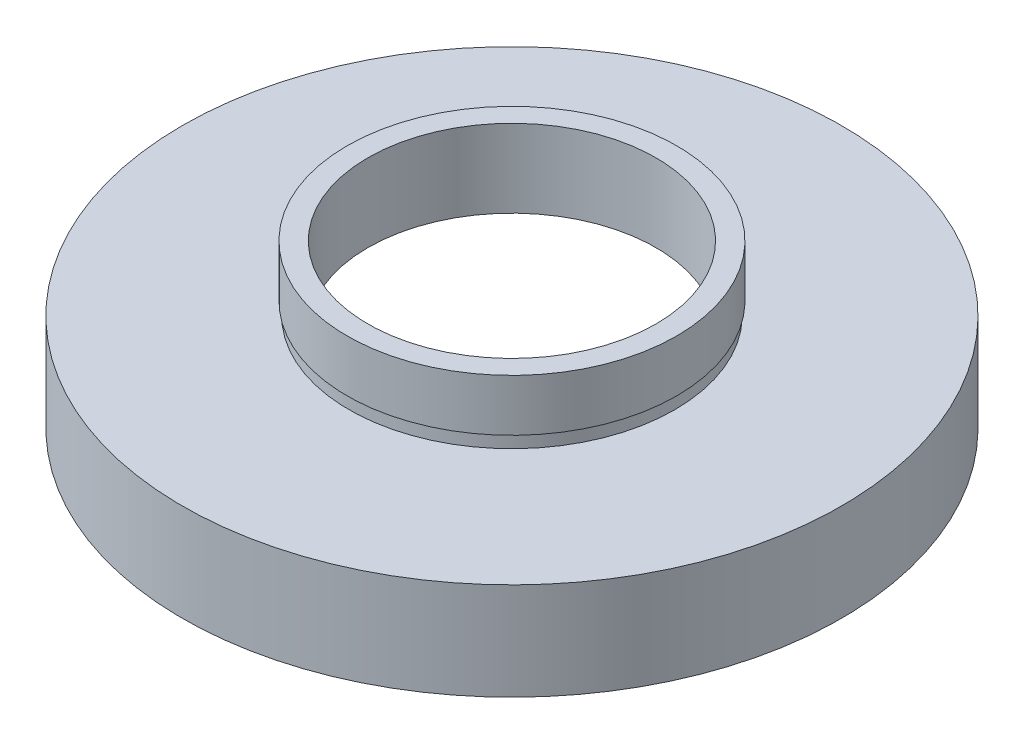
ISO-10303-21;
HEADER;
FILE_DESCRIPTION(('STEP AP214'),'2;1');
FILE_NAME('part.step','',(''),(''),'','','');
FILE_SCHEMA(('AUTOMOTIVE_DESIGN { 1 0 10303 214 1 1 1 1 }'));
ENDSEC;
DATA;
#1=APPLICATION_CONTEXT('core data for automotive mechanical design processes');
#2=APPLICATION_PROTOCOL_DEFINITION('international standard','automotive_design',2000,#1);
#3=PRODUCT_CONTEXT('',#1,'mechanical');
#4=PRODUCT('Part','Part','',(#3));
#5=PRODUCT_RELATED_PRODUCT_CATEGORY('part','',(#4));
#6=PRODUCT_DEFINITION_FORMATION('','',#4);
#7=PRODUCT_DEFINITION_CONTEXT('part definition',#1,'design');
#8=PRODUCT_DEFINITION('design','',#6,#7);
#9=PRODUCT_DEFINITION_SHAPE('','',#8);
#10=(LENGTH_UNIT() NAMED_UNIT(*) SI_UNIT(.MILLI.,.METRE.));
#11=(NAMED_UNIT(*) PLANE_ANGLE_UNIT() SI_UNIT($,.RADIAN.));
#12=(NAMED_UNIT(*) SI_UNIT($,.STERADIAN.) SOLID_ANGLE_UNIT());
#13=UNCERTAINTY_MEASURE_WITH_UNIT(LENGTH_MEASURE(1.E-05),#10,'distance_accuracy_value','');
#14=(GEOMETRIC_REPRESENTATION_CONTEXT(3) GLOBAL_UNCERTAINTY_ASSIGNED_CONTEXT((#13)) GLOBAL_UNIT_ASSIGNED_CONTEXT((#10,
#11,#12)) REPRESENTATION_CONTEXT('',''));
#15=CARTESIAN_POINT('',(0.,0.,0.));
#16=DIRECTION('',(0.,0.,1.));
#17=DIRECTION('',(1.,0.,0.));
#18=AXIS2_PLACEMENT_3D('',#15,#16,#17);
#19=CARTESIAN_POINT('',(25.4,0.,0.));
#20=DIRECTION('',(0.,1.,0.));
#21=DIRECTION('',(-1.,0.,0.));
#22=AXIS2_PLACEMENT_3D('',#19,#20,#21);
#23=PLANE('',#22);
#24=CARTESIAN_POINT('',(0.,0.,0.));
#25=DIRECTION('',(0.,1.,0.));
#26=DIRECTION('',(-1.,0.,0.));
#27=AXIS2_PLACEMENT_3D('',#24,#25,#26);
#28=CIRCLE('',#27,25.4);
#29=CARTESIAN_POINT('',(-25.4,0.,0.));
#30=VERTEX_POINT('',#29);
#31=EDGE_CURVE('E91',#30,#30,#28,.T.);
#32=ORIENTED_EDGE('',*,*,#31,.F.);
#33=EDGE_LOOP('',(#32));
#34=FACE_BOUND('',#33,.T.);
#35=CARTESIAN_POINT('',(0.,0.,0.));
#36=DIRECTION('',(0.,1.,0.));
#37=DIRECTION('',(-1.,0.,0.));
#38=AXIS2_PLACEMENT_3D('',#35,#36,#37);
#39=CIRCLE('',#38,20.5);
#40=CARTESIAN_POINT('',(-20.5,0.,0.));
#41=VERTEX_POINT('',#40);
#42=EDGE_CURVE('E10',#41,#41,#39,.T.);
#43=ORIENTED_EDGE('',*,*,#42,.T.);
#44=EDGE_LOOP('',(#43));
#45=FACE_BOUND('',#44,.T.);
#46=ADVANCED_FACE('F39',(#34,#45),#23,.F.);
#47=CARTESIAN_POINT('',(0.,16.8860182370821,0.));
#48=DIRECTION('',(0.,1.,0.));
#49=DIRECTION('',(-1.,0.,0.));
#50=AXIS2_PLACEMENT_3D('',#47,#48,#49);
#51=CYLINDRICAL_SURFACE('',#50,20.5);
#52=ORIENTED_EDGE('',*,*,#42,.F.);
#53=EDGE_LOOP('',(#52));
#54=FACE_BOUND('',#53,.T.);
#55=CARTESIAN_POINT('',(0.,5.5,0.));
#56=DIRECTION('',(0.,1.,0.));
#57=DIRECTION('',(-1.,0.,0.));
#58=AXIS2_PLACEMENT_3D('',#55,#56,#57);
#59=CIRCLE('',#58,20.5);
#60=CARTESIAN_POINT('',(-20.5,5.5,0.));
#61=VERTEX_POINT('',#60);
#62=EDGE_CURVE('E46',#61,#61,#59,.T.);
#63=ORIENTED_EDGE('',*,*,#62,.T.);
#64=EDGE_LOOP('',(#63));
#65=FACE_BOUND('',#64,.T.);
#66=ADVANCED_FACE('F98',(#54,#65),#51,.F.);
#67=CARTESIAN_POINT('',(20.5,5.5,0.));
#68=DIRECTION('',(0.,-1.,0.));
#69=DIRECTION('',(1.,0.,0.));
#70=AXIS2_PLACEMENT_3D('',#67,#68,#69);
#71=PLANE('',#70);
#72=ORIENTED_EDGE('',*,*,#62,.F.);
#73=EDGE_LOOP('',(#72));
#74=FACE_BOUND('',#73,.T.);
#75=CARTESIAN_POINT('',(0.,5.5,0.));
#76=DIRECTION('',(0.,1.,0.));
#77=DIRECTION('',(-1.,0.,0.));
#78=AXIS2_PLACEMENT_3D('',#75,#76,#77);
#79=CIRCLE('',#78,21.1);
#80=CARTESIAN_POINT('',(-21.1,5.49999999999999,0.));
#81=VERTEX_POINT('',#80);
#82=EDGE_CURVE('E52',#81,#81,#79,.T.);
#83=ORIENTED_EDGE('',*,*,#82,.T.);
#84=EDGE_LOOP('',(#83));
#85=FACE_BOUND('',#84,.T.);
#86=ADVANCED_FACE('F102',(#74,#85),#71,.F.);
#87=CARTESIAN_POINT('',(0.,16.8860182370821,0.));
#88=DIRECTION('',(0.,1.,0.));
#89=DIRECTION('',(-1.,0.,0.));
#90=AXIS2_PLACEMENT_3D('',#87,#88,#89);
#91=CYLINDRICAL_SURFACE('',#90,21.1);
#92=ORIENTED_EDGE('',*,*,#82,.F.);
#93=EDGE_LOOP('',(#92));
#94=FACE_BOUND('',#93,.T.);
#95=CARTESIAN_POINT('',(0.,6.5,0.));
#96=DIRECTION('',(0.,1.,0.));
#97=DIRECTION('',(-1.,0.,0.));
#98=AXIS2_PLACEMENT_3D('',#95,#96,#97);
#99=CIRCLE('',#98,21.1);
#100=CARTESIAN_POINT('',(-21.1,6.49999999999999,0.));
#101=VERTEX_POINT('',#100);
#102=EDGE_CURVE('E58',#101,#101,#99,.T.);
#103=ORIENTED_EDGE('',*,*,#102,.T.);
#104=EDGE_LOOP('',(#103));
#105=FACE_BOUND('',#104,.T.);
#106=ADVANCED_FACE('F107',(#94,#105),#91,.F.);
#107=CARTESIAN_POINT('',(11.1,6.5,0.));
#108=DIRECTION('',(0.,1.,0.));
#109=DIRECTION('',(-1.,0.,0.));
#110=AXIS2_PLACEMENT_3D('',#107,#108,#109);
#111=PLANE('',#110);
#112=ORIENTED_EDGE('',*,*,#102,.F.);
#113=EDGE_LOOP('',(#112));
#114=FACE_BOUND('',#113,.T.);
#115=CARTESIAN_POINT('',(0.,6.5,0.));
#116=DIRECTION('',(0.,1.,0.));
#117=DIRECTION('',(-1.,0.,0.));
#118=AXIS2_PLACEMENT_3D('',#115,#116,#117);
#119=CIRCLE('',#118,11.1);
#120=CARTESIAN_POINT('',(-11.1,6.5,0.));
#121=VERTEX_POINT('',#120);
#122=EDGE_CURVE('E64',#121,#121,#119,.T.);
#123=ORIENTED_EDGE('',*,*,#122,.T.);
#124=EDGE_LOOP('',(#123));
#125=FACE_BOUND('',#124,.T.);
#126=ADVANCED_FACE('F113',(#114,#125),#111,.F.);
#127=CARTESIAN_POINT('',(0.,16.8860182370821,0.));
#128=DIRECTION('',(0.,1.,0.));
#129=DIRECTION('',(-1.,0.,0.));
#130=AXIS2_PLACEMENT_3D('',#127,#128,#129);
#131=CYLINDRICAL_SURFACE('',#130,11.1);
#132=ORIENTED_EDGE('',*,*,#122,.F.);
#133=EDGE_LOOP('',(#132));
#134=FACE_BOUND('',#133,.T.);
#135=CARTESIAN_POINT('',(0.,12.5,0.));
#136=DIRECTION('',(0.,1.,0.));
#137=DIRECTION('',(-1.,0.,0.));
#138=AXIS2_PLACEMENT_3D('',#135,#136,#137);
#139=CIRCLE('',#138,11.1);
#140=CARTESIAN_POINT('',(-11.1,12.5,0.));
#141=VERTEX_POINT('',#140);
#142=EDGE_CURVE('E68',#141,#141,#139,.T.);
#143=ORIENTED_EDGE('',*,*,#142,.T.);
#144=EDGE_LOOP('',(#143));
#145=FACE_BOUND('',#144,.T.);
#146=ADVANCED_FACE('F117',(#134,#145),#131,.F.);
#147=CARTESIAN_POINT('',(11.1,12.5,0.));
#148=DIRECTION('',(0.,-1.,0.));
#149=DIRECTION('',(1.,0.,0.));
#150=AXIS2_PLACEMENT_3D('',#147,#148,#149);
#151=PLANE('',#150);
#152=ORIENTED_EDGE('',*,*,#142,.F.);
#153=EDGE_LOOP('',(#152));
#154=FACE_BOUND('',#153,.T.);
#155=CARTESIAN_POINT('',(0.,12.5,0.));
#156=DIRECTION('',(0.,1.,0.));
#157=DIRECTION('',(-1.,0.,0.));
#158=AXIS2_PLACEMENT_3D('',#155,#156,#157);
#159=CIRCLE('',#158,12.7);
#160=CARTESIAN_POINT('',(-12.7,12.5,0.));
#161=VERTEX_POINT('',#160);
#162=EDGE_CURVE('E72',#161,#161,#159,.T.);
#163=ORIENTED_EDGE('',*,*,#162,.T.);
#164=EDGE_LOOP('',(#163));
#165=FACE_BOUND('',#164,.T.);
#166=ADVANCED_FACE('F121',(#154,#165),#151,.F.);
#167=CARTESIAN_POINT('',(0.,16.8860182370821,0.));
#168=DIRECTION('',(0.,1.,0.));
#169=DIRECTION('',(-1.,0.,0.));
#170=AXIS2_PLACEMENT_3D('',#167,#168,#169);
#171=CYLINDRICAL_SURFACE('',#170,12.7);
#172=ORIENTED_EDGE('',*,*,#162,.F.);
#173=EDGE_LOOP('',(#172));
#174=FACE_BOUND('',#173,.T.);
#175=CARTESIAN_POINT('',(0.,8.5,0.));
#176=DIRECTION('',(0.,1.,0.));
#177=DIRECTION('',(-1.,0.,0.));
#178=AXIS2_PLACEMENT_3D('',#175,#176,#177);
#179=CIRCLE('',#178,12.7);
#180=CARTESIAN_POINT('',(-12.7,8.5,0.));
#181=VERTEX_POINT('',#180);
#182=EDGE_CURVE('E76',#181,#181,#179,.T.);
#183=ORIENTED_EDGE('',*,*,#182,.T.);
#184=EDGE_LOOP('',(#183));
#185=FACE_BOUND('',#184,.T.);
#186=ADVANCED_FACE('F125',(#174,#185),#171,.T.);
#187=CARTESIAN_POINT('',(12.7,8.5,0.));
#188=DIRECTION('',(0.,1.,0.));
#189=DIRECTION('',(-1.,0.,0.));
#190=AXIS2_PLACEMENT_3D('',#187,#188,#189);
#191=PLANE('',#190);
#192=ORIENTED_EDGE('',*,*,#182,.F.);
#193=EDGE_LOOP('',(#192));
#194=FACE_BOUND('',#193,.T.);
#195=CARTESIAN_POINT('',(0.,8.5,0.));
#196=DIRECTION('',(0.,1.,0.));
#197=DIRECTION('',(-1.,0.,0.));
#198=AXIS2_PLACEMENT_3D('',#195,#196,#197);
#199=CIRCLE('',#198,12.55);
#200=CARTESIAN_POINT('',(-12.55,8.5,0.));
#201=VERTEX_POINT('',#200);
#202=EDGE_CURVE('E80',#201,#201,#199,.T.);
#203=ORIENTED_EDGE('',*,*,#202,.T.);
#204=EDGE_LOOP('',(#203));
#205=FACE_BOUND('',#204,.T.);
#206=ADVANCED_FACE('F129',(#194,#205),#191,.F.);
#207=CARTESIAN_POINT('',(0.,16.8860182370821,0.));
#208=DIRECTION('',(0.,1.,0.));
#209=DIRECTION('',(-1.,0.,0.));
#210=AXIS2_PLACEMENT_3D('',#207,#208,#209);
#211=CYLINDRICAL_SURFACE('',#210,12.55);
#212=ORIENTED_EDGE('',*,*,#202,.F.);
#213=EDGE_LOOP('',(#212));
#214=FACE_BOUND('',#213,.T.);
#215=CARTESIAN_POINT('',(0.,7.5,0.));
#216=DIRECTION('',(0.,1.,0.));
#217=DIRECTION('',(-1.,0.,0.));
#218=AXIS2_PLACEMENT_3D('',#215,#216,#217);
#219=CIRCLE('',#218,12.55);
#220=CARTESIAN_POINT('',(-12.55,7.5,0.));
#221=VERTEX_POINT('',#220);
#222=EDGE_CURVE('E84',#221,#221,#219,.T.);
#223=ORIENTED_EDGE('',*,*,#222,.T.);
#224=EDGE_LOOP('',(#223));
#225=FACE_BOUND('',#224,.T.);
#226=ADVANCED_FACE('F133',(#214,#225),#211,.T.);
#227=CARTESIAN_POINT('',(12.55,7.5,0.));
#228=DIRECTION('',(0.,-1.,0.));
#229=DIRECTION('',(1.,0.,0.));
#230=AXIS2_PLACEMENT_3D('',#227,#228,#229);
#231=PLANE('',#230);
#232=ORIENTED_EDGE('',*,*,#222,.F.);
#233=EDGE_LOOP('',(#232));
#234=FACE_BOUND('',#233,.T.);
#235=CARTESIAN_POINT('',(0.,7.5,0.));
#236=DIRECTION('',(0.,1.,0.));
#237=DIRECTION('',(-1.,0.,0.));
#238=AXIS2_PLACEMENT_3D('',#235,#236,#237);
#239=CIRCLE('',#238,25.4);
#240=CARTESIAN_POINT('',(-25.4,7.49999999999999,0.));
#241=VERTEX_POINT('',#240);
#242=EDGE_CURVE('E87',#241,#241,#239,.T.);
#243=ORIENTED_EDGE('',*,*,#242,.T.);
#244=EDGE_LOOP('',(#243));
#245=FACE_BOUND('',#244,.T.);
#246=ADVANCED_FACE('F137',(#234,#245),#231,.F.);
#247=CARTESIAN_POINT('',(0.,16.8860182370821,0.));
#248=DIRECTION('',(0.,1.,0.));
#249=DIRECTION('',(-1.,0.,0.));
#250=AXIS2_PLACEMENT_3D('',#247,#248,#249);
#251=CYLINDRICAL_SURFACE('',#250,25.4);
#252=ORIENTED_EDGE('',*,*,#242,.F.);
#253=EDGE_LOOP('',(#252));
#254=FACE_BOUND('',#253,.T.);
#255=ORIENTED_EDGE('',*,*,#31,.T.);
#256=EDGE_LOOP('',(#255));
#257=FACE_BOUND('',#256,.T.);
#258=ADVANCED_FACE('F95',(#254,#257),#251,.T.);
#259=CLOSED_SHELL('',(#46,#66,#86,#106,#126,#146,#166,#186,#206,#226,#246,#258));
#260=MANIFOLD_SOLID_BREP('B2',#259);
#261=ADVANCED_BREP_SHAPE_REPRESENTATION('',(#18,#260),#14);
#262=SHAPE_DEFINITION_REPRESENTATION(#9,#261);
ENDSEC;
END-ISO-10303-21;
